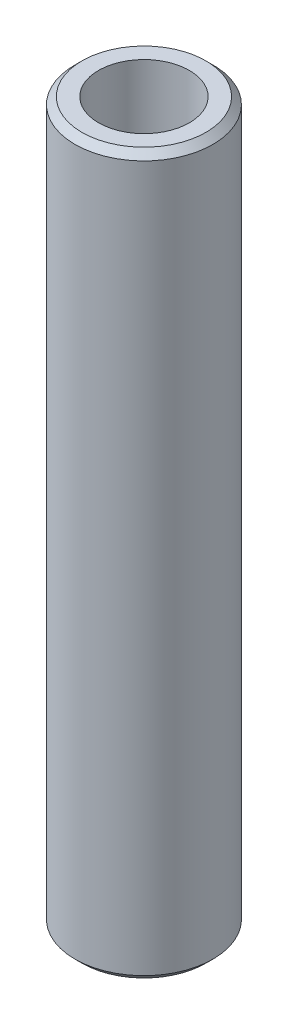
ISO-10303-21;
HEADER;
FILE_DESCRIPTION(('STEP AP214'),'2;1');
FILE_NAME('part.step','',(''),(''),'','','');
FILE_SCHEMA(('AUTOMOTIVE_DESIGN { 1 0 10303 214 1 1 1 1 }'));
ENDSEC;
DATA;
#1=APPLICATION_CONTEXT('core data for automotive mechanical design processes');
#2=APPLICATION_PROTOCOL_DEFINITION('international standard','automotive_design',2000,#1);
#3=PRODUCT_CONTEXT('',#1,'mechanical');
#4=PRODUCT('Part','Part','',(#3));
#5=PRODUCT_RELATED_PRODUCT_CATEGORY('part','',(#4));
#6=PRODUCT_DEFINITION_FORMATION('','',#4);
#7=PRODUCT_DEFINITION_CONTEXT('part definition',#1,'design');
#8=PRODUCT_DEFINITION('design','',#6,#7);
#9=PRODUCT_DEFINITION_SHAPE('','',#8);
#10=(LENGTH_UNIT() NAMED_UNIT(*) SI_UNIT(.MILLI.,.METRE.));
#11=(NAMED_UNIT(*) PLANE_ANGLE_UNIT() SI_UNIT($,.RADIAN.));
#12=(NAMED_UNIT(*) SI_UNIT($,.STERADIAN.) SOLID_ANGLE_UNIT());
#13=UNCERTAINTY_MEASURE_WITH_UNIT(LENGTH_MEASURE(1.E-05),#10,'distance_accuracy_value','');
#14=(GEOMETRIC_REPRESENTATION_CONTEXT(3) GLOBAL_UNCERTAINTY_ASSIGNED_CONTEXT((#13)) GLOBAL_UNIT_ASSIGNED_CONTEXT((#10,
#11,#12)) REPRESENTATION_CONTEXT('',''));
#15=CARTESIAN_POINT('',(0.,0.,0.));
#16=DIRECTION('',(0.,0.,1.));
#17=DIRECTION('',(1.,0.,0.));
#18=AXIS2_PLACEMENT_3D('',#15,#16,#17);
#19=CARTESIAN_POINT('',(0.,600.,0.));
#20=DIRECTION('',(0.,-1.,0.));
#21=DIRECTION('',(0.,0.,-1.));
#22=AXIS2_PLACEMENT_3D('',#19,#20,#21);
#23=CYLINDRICAL_SURFACE('',#22,57.5);
#24=CARTESIAN_POINT('',(0.,594.191940472691,0.));
#25=DIRECTION('',(0.,1.,0.));
#26=DIRECTION('',(0.,0.,1.));
#27=AXIS2_PLACEMENT_3D('',#24,#25,#26);
#28=CIRCLE('',#27,57.5);
#29=CARTESIAN_POINT('',(0.,594.191940472691,57.5));
#30=VERTEX_POINT('',#29);
#31=EDGE_CURVE('E50',#30,#30,#28,.F.);
#32=ORIENTED_EDGE('',*,*,#31,.T.);
#33=EDGE_LOOP('',(#32));
#34=FACE_BOUND('',#33,.T.);
#35=CARTESIAN_POINT('',(0.,5.80805952730867,0.));
#36=DIRECTION('',(0.,1.,0.));
#37=DIRECTION('',(0.,0.,1.));
#38=AXIS2_PLACEMENT_3D('',#35,#36,#37);
#39=CIRCLE('',#38,57.5);
#40=CARTESIAN_POINT('',(0.,5.80805952730867,57.5));
#41=VERTEX_POINT('',#40);
#42=EDGE_CURVE('E51',#41,#41,#39,.T.);
#43=ORIENTED_EDGE('',*,*,#42,.T.);
#44=EDGE_LOOP('',(#43));
#45=FACE_BOUND('',#44,.T.);
#46=ADVANCED_FACE('F39',(#34,#45),#23,.T.);
#47=CARTESIAN_POINT('',(0.,600.,0.));
#48=DIRECTION('',(0.,1.,0.));
#49=DIRECTION('',(0.,0.,1.));
#50=AXIS2_PLACEMENT_3D('',#47,#48,#49);
#51=PLANE('',#50);
#52=CARTESIAN_POINT('',(0.,600.,0.));
#53=DIRECTION('',(0.,1.,0.));
#54=DIRECTION('',(0.,0.,1.));
#55=AXIS2_PLACEMENT_3D('',#52,#53,#54);
#56=CIRCLE('',#55,51.6919404726913);
#57=CARTESIAN_POINT('',(0.,600.,51.6919404726913));
#58=VERTEX_POINT('',#57);
#59=EDGE_CURVE('E54',#58,#58,#56,.T.);
#60=ORIENTED_EDGE('',*,*,#59,.T.);
#61=EDGE_LOOP('',(#60));
#62=FACE_BOUND('',#61,.T.);
#63=CARTESIAN_POINT('',(0.,600.,0.));
#64=DIRECTION('',(0.,1.,0.));
#65=DIRECTION('',(0.,0.,1.));
#66=AXIS2_PLACEMENT_3D('',#63,#64,#65);
#67=CIRCLE('',#66,37.8635868024962);
#68=CARTESIAN_POINT('',(0.,600.,37.8635868024962));
#69=VERTEX_POINT('',#68);
#70=EDGE_CURVE('E58',#69,#69,#67,.T.);
#71=ORIENTED_EDGE('',*,*,#70,.F.);
#72=EDGE_LOOP('',(#71));
#73=FACE_BOUND('',#72,.T.);
#74=ADVANCED_FACE('F69',(#62,#73),#51,.T.);
#75=CARTESIAN_POINT('',(0.,0.,0.));
#76=DIRECTION('',(0.,1.,0.));
#77=DIRECTION('',(0.,0.,1.));
#78=AXIS2_PLACEMENT_3D('',#75,#76,#77);
#79=PLANE('',#78);
#80=CARTESIAN_POINT('',(0.,0.,0.));
#81=DIRECTION('',(0.,1.,0.));
#82=DIRECTION('',(0.,0.,1.));
#83=AXIS2_PLACEMENT_3D('',#80,#81,#82);
#84=CIRCLE('',#83,51.6919404726913);
#85=CARTESIAN_POINT('',(0.,0.,51.6919404726913));
#86=VERTEX_POINT('',#85);
#87=EDGE_CURVE('E10',#86,#86,#84,.F.);
#88=ORIENTED_EDGE('',*,*,#87,.T.);
#89=EDGE_LOOP('',(#88));
#90=FACE_BOUND('',#89,.T.);
#91=CARTESIAN_POINT('',(0.,0.,0.));
#92=DIRECTION('',(0.,1.,0.));
#93=DIRECTION('',(0.,0.,1.));
#94=AXIS2_PLACEMENT_3D('',#91,#92,#93);
#95=CIRCLE('',#94,37.8635868024962);
#96=CARTESIAN_POINT('',(0.,0.,37.8635868024962));
#97=VERTEX_POINT('',#96);
#98=EDGE_CURVE('E63',#97,#97,#95,.T.);
#99=ORIENTED_EDGE('',*,*,#98,.T.);
#100=EDGE_LOOP('',(#99));
#101=FACE_BOUND('',#100,.T.);
#102=ADVANCED_FACE('F75',(#90,#101),#79,.F.);
#103=CARTESIAN_POINT('',(0.,600.,0.));
#104=DIRECTION('',(0.,-1.,0.));
#105=DIRECTION('',(0.,0.,-1.));
#106=AXIS2_PLACEMENT_3D('',#103,#104,#105);
#107=CYLINDRICAL_SURFACE('',#106,37.8635868024962);
#108=ORIENTED_EDGE('',*,*,#70,.T.);
#109=EDGE_LOOP('',(#108));
#110=FACE_BOUND('',#109,.T.);
#111=ORIENTED_EDGE('',*,*,#98,.F.);
#112=EDGE_LOOP('',(#111));
#113=FACE_BOUND('',#112,.T.);
#114=ADVANCED_FACE('F70',(#110,#113),#107,.F.);
#115=CARTESIAN_POINT('',(0.,600.,0.));
#116=DIRECTION('',(0.,-1.,0.));
#117=DIRECTION('',(0.,0.,-1.));
#118=AXIS2_PLACEMENT_3D('',#115,#116,#117);
#119=CONICAL_SURFACE('',#118,51.6919404726913,0.785398163397449);
#120=ORIENTED_EDGE('',*,*,#31,.F.);
#121=EDGE_LOOP('',(#120));
#122=FACE_BOUND('',#121,.T.);
#123=ORIENTED_EDGE('',*,*,#59,.F.);
#124=EDGE_LOOP('',(#123));
#125=FACE_BOUND('',#124,.T.);
#126=ADVANCED_FACE('F81',(#122,#125),#119,.T.);
#127=CARTESIAN_POINT('',(0.,5.80805952730867,0.));
#128=DIRECTION('',(0.,1.,0.));
#129=DIRECTION('',(0.,0.,1.));
#130=AXIS2_PLACEMENT_3D('',#127,#128,#129);
#131=CONICAL_SURFACE('',#130,57.5,0.785398163397453);
#132=ORIENTED_EDGE('',*,*,#87,.F.);
#133=EDGE_LOOP('',(#132));
#134=FACE_BOUND('',#133,.T.);
#135=ORIENTED_EDGE('',*,*,#42,.F.);
#136=EDGE_LOOP('',(#135));
#137=FACE_BOUND('',#136,.T.);
#138=ADVANCED_FACE('F45',(#134,#137),#131,.T.);
#139=CLOSED_SHELL('',(#46,#74,#102,#114,#126,#138));
#140=MANIFOLD_SOLID_BREP('B2',#139);
#141=ADVANCED_BREP_SHAPE_REPRESENTATION('',(#18,#140),#14);
#142=SHAPE_DEFINITION_REPRESENTATION(#9,#141);
ENDSEC;
END-ISO-10303-21;
